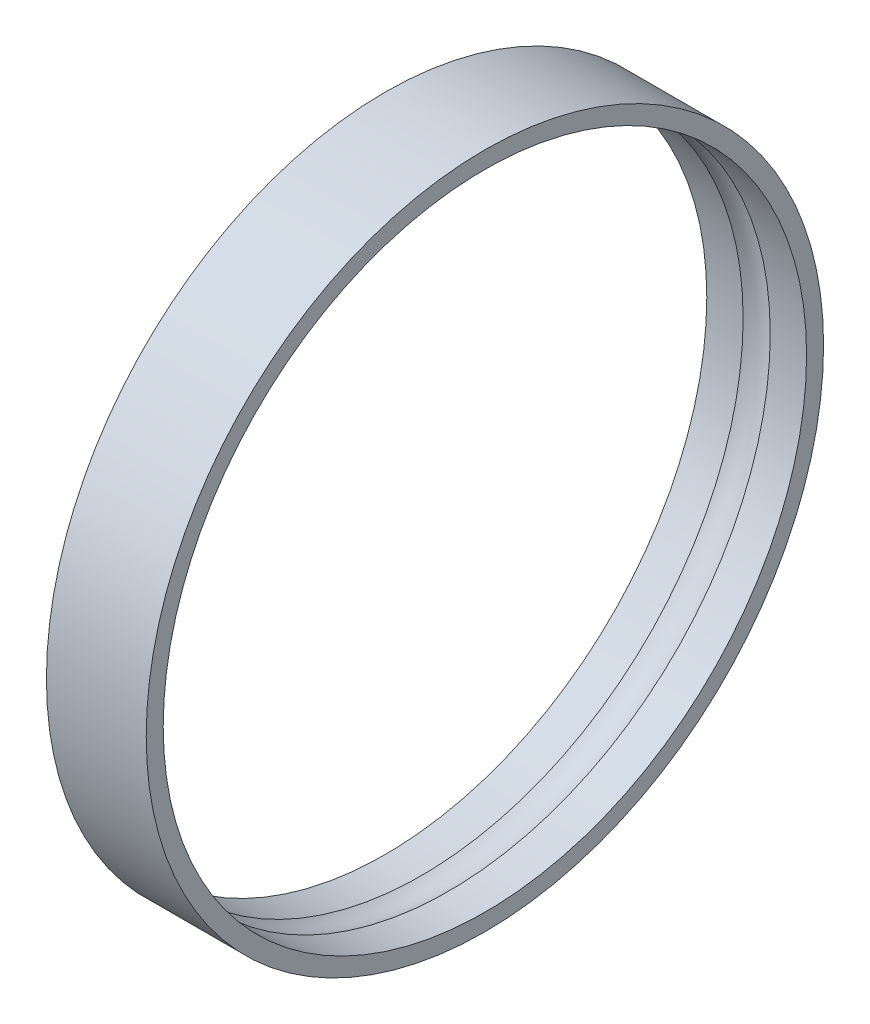
ISO-10303-21;
HEADER;
FILE_DESCRIPTION(('STEP AP214'),'2;1');
FILE_NAME('part.step','',(''),(''),'','','');
FILE_SCHEMA(('AUTOMOTIVE_DESIGN { 1 0 10303 214 1 1 1 1 }'));
ENDSEC;
DATA;
#1=APPLICATION_CONTEXT('core data for automotive mechanical design processes');
#2=APPLICATION_PROTOCOL_DEFINITION('international standard','automotive_design',2000,#1);
#3=PRODUCT_CONTEXT('',#1,'mechanical');
#4=PRODUCT('Part','Part','',(#3));
#5=PRODUCT_RELATED_PRODUCT_CATEGORY('part','',(#4));
#6=PRODUCT_DEFINITION_FORMATION('','',#4);
#7=PRODUCT_DEFINITION_CONTEXT('part definition',#1,'design');
#8=PRODUCT_DEFINITION('design','',#6,#7);
#9=PRODUCT_DEFINITION_SHAPE('','',#8);
#10=(LENGTH_UNIT() NAMED_UNIT(*) SI_UNIT(.MILLI.,.METRE.));
#11=(NAMED_UNIT(*) PLANE_ANGLE_UNIT() SI_UNIT($,.RADIAN.));
#12=(NAMED_UNIT(*) SI_UNIT($,.STERADIAN.) SOLID_ANGLE_UNIT());
#13=UNCERTAINTY_MEASURE_WITH_UNIT(LENGTH_MEASURE(1.E-05),#10,'distance_accuracy_value','');
#14=(GEOMETRIC_REPRESENTATION_CONTEXT(3) GLOBAL_UNCERTAINTY_ASSIGNED_CONTEXT((#13)) GLOBAL_UNIT_ASSIGNED_CONTEXT((#10,
#11,#12)) REPRESENTATION_CONTEXT('',''));
#15=CARTESIAN_POINT('',(0.,0.,0.));
#16=DIRECTION('',(0.,0.,1.));
#17=DIRECTION('',(1.,0.,0.));
#18=AXIS2_PLACEMENT_3D('',#15,#16,#17);
#19=CARTESIAN_POINT('',(67.76,0.,0.));
#20=DIRECTION('',(1.,0.,0.));
#21=DIRECTION('',(0.,0.,-1.));
#22=AXIS2_PLACEMENT_3D('',#19,#20,#21);
#23=TOROIDAL_SURFACE('',#22,69.3475,7.15);
#24=CARTESIAN_POINT('',(64.5671182687109,0.,0.));
#25=DIRECTION('',(-1.,0.,0.));
#26=DIRECTION('',(0.,0.,1.));
#27=AXIS2_PLACEMENT_3D('',#24,#25,#26);
#28=CIRCLE('',#27,75.745);
#29=CARTESIAN_POINT('',(64.5671182687109,0.,75.745));
#30=VERTEX_POINT('',#29);
#31=EDGE_CURVE('E31',#30,#30,#28,.T.);
#32=ORIENTED_EDGE('',*,*,#31,.T.);
#33=EDGE_LOOP('',(#32));
#34=FACE_BOUND('',#33,.T.);
#35=CARTESIAN_POINT('',(70.9528817312891,0.,0.));
#36=DIRECTION('',(-1.,0.,0.));
#37=DIRECTION('',(0.,0.,1.));
#38=AXIS2_PLACEMENT_3D('',#35,#36,#37);
#39=CIRCLE('',#38,75.745);
#40=CARTESIAN_POINT('',(70.9528817312891,0.,75.745));
#41=VERTEX_POINT('',#40);
#42=EDGE_CURVE('E36',#41,#41,#39,.F.);
#43=ORIENTED_EDGE('',*,*,#42,.T.);
#44=EDGE_LOOP('',(#43));
#45=FACE_BOUND('',#44,.T.);
#46=ADVANCED_FACE('F15',(#34,#45),#23,.F.);
#47=CARTESIAN_POINT('',(67.76,0.,0.));
#48=DIRECTION('',(-1.,0.,0.));
#49=DIRECTION('',(0.,0.,1.));
#50=AXIS2_PLACEMENT_3D('',#47,#48,#49);
#51=CYLINDRICAL_SURFACE('',#50,75.745);
#52=CARTESIAN_POINT('',(56.01,0.,0.));
#53=DIRECTION('',(-1.,0.,0.));
#54=DIRECTION('',(0.,0.,1.));
#55=AXIS2_PLACEMENT_3D('',#52,#53,#54);
#56=CIRCLE('',#55,75.745);
#57=CARTESIAN_POINT('',(56.01,0.,75.745));
#58=VERTEX_POINT('',#57);
#59=EDGE_CURVE('E19',#58,#58,#56,.F.);
#60=ORIENTED_EDGE('',*,*,#59,.F.);
#61=EDGE_LOOP('',(#60));
#62=FACE_BOUND('',#61,.T.);
#63=ORIENTED_EDGE('',*,*,#31,.F.);
#64=EDGE_LOOP('',(#63));
#65=FACE_BOUND('',#64,.T.);
#66=ADVANCED_FACE('F48',(#62,#65),#51,.F.);
#67=CARTESIAN_POINT('',(67.76,0.,0.));
#68=DIRECTION('',(-1.,0.,0.));
#69=DIRECTION('',(0.,0.,1.));
#70=AXIS2_PLACEMENT_3D('',#67,#68,#69);
#71=CYLINDRICAL_SURFACE('',#70,75.745);
#72=ORIENTED_EDGE('',*,*,#42,.F.);
#73=EDGE_LOOP('',(#72));
#74=FACE_BOUND('',#73,.T.);
#75=CARTESIAN_POINT('',(79.51,0.,0.));
#76=DIRECTION('',(-1.,0.,0.));
#77=DIRECTION('',(0.,0.,1.));
#78=AXIS2_PLACEMENT_3D('',#75,#76,#77);
#79=CIRCLE('',#78,75.745);
#80=CARTESIAN_POINT('',(79.51,0.,75.745));
#81=VERTEX_POINT('',#80);
#82=EDGE_CURVE('E28',#81,#81,#79,.T.);
#83=ORIENTED_EDGE('',*,*,#82,.F.);
#84=EDGE_LOOP('',(#83));
#85=FACE_BOUND('',#84,.T.);
#86=ADVANCED_FACE('F50',(#74,#85),#71,.F.);
#87=CARTESIAN_POINT('',(56.01,0.,77.745));
#88=DIRECTION('',(-1.,0.,0.));
#89=DIRECTION('',(0.,0.,1.));
#90=AXIS2_PLACEMENT_3D('',#87,#88,#89);
#91=PLANE('',#90);
#92=ORIENTED_EDGE('',*,*,#59,.T.);
#93=EDGE_LOOP('',(#92));
#94=FACE_BOUND('',#93,.T.);
#95=CARTESIAN_POINT('',(56.01,0.,0.));
#96=DIRECTION('',(-1.,0.,0.));
#97=DIRECTION('',(0.,0.,1.));
#98=AXIS2_PLACEMENT_3D('',#95,#96,#97);
#99=CIRCLE('',#98,79.745);
#100=CARTESIAN_POINT('',(56.01,0.,79.745));
#101=VERTEX_POINT('',#100);
#102=EDGE_CURVE('E23',#101,#101,#99,.F.);
#103=ORIENTED_EDGE('',*,*,#102,.F.);
#104=EDGE_LOOP('',(#103));
#105=FACE_BOUND('',#104,.T.);
#106=ADVANCED_FACE('F57',(#94,#105),#91,.T.);
#107=CARTESIAN_POINT('',(79.51,0.,77.745));
#108=DIRECTION('',(1.,0.,0.));
#109=DIRECTION('',(0.,0.,-1.));
#110=AXIS2_PLACEMENT_3D('',#107,#108,#109);
#111=PLANE('',#110);
#112=CARTESIAN_POINT('',(79.51,0.,0.));
#113=DIRECTION('',(-1.,0.,0.));
#114=DIRECTION('',(0.,0.,1.));
#115=AXIS2_PLACEMENT_3D('',#112,#113,#114);
#116=CIRCLE('',#115,79.745);
#117=CARTESIAN_POINT('',(79.51,0.,79.745));
#118=VERTEX_POINT('',#117);
#119=EDGE_CURVE('E10',#118,#118,#116,.T.);
#120=ORIENTED_EDGE('',*,*,#119,.F.);
#121=EDGE_LOOP('',(#120));
#122=FACE_BOUND('',#121,.T.);
#123=ORIENTED_EDGE('',*,*,#82,.T.);
#124=EDGE_LOOP('',(#123));
#125=FACE_BOUND('',#124,.T.);
#126=ADVANCED_FACE('F62',(#122,#125),#111,.T.);
#127=CARTESIAN_POINT('',(67.76,0.,0.));
#128=DIRECTION('',(-1.,0.,0.));
#129=DIRECTION('',(0.,0.,1.));
#130=AXIS2_PLACEMENT_3D('',#127,#128,#129);
#131=CYLINDRICAL_SURFACE('',#130,79.745);
#132=ORIENTED_EDGE('',*,*,#102,.T.);
#133=EDGE_LOOP('',(#132));
#134=FACE_BOUND('',#133,.T.);
#135=ORIENTED_EDGE('',*,*,#119,.T.);
#136=EDGE_LOOP('',(#135));
#137=FACE_BOUND('',#136,.T.);
#138=ADVANCED_FACE('F60',(#134,#137),#131,.T.);
#139=CLOSED_SHELL('',(#46,#66,#86,#106,#126,#138));
#140=MANIFOLD_SOLID_BREP('B1',#139);
#141=ADVANCED_BREP_SHAPE_REPRESENTATION('',(#18,#140),#14);
#142=SHAPE_DEFINITION_REPRESENTATION(#9,#141);
ENDSEC;
END-ISO-10303-21;
